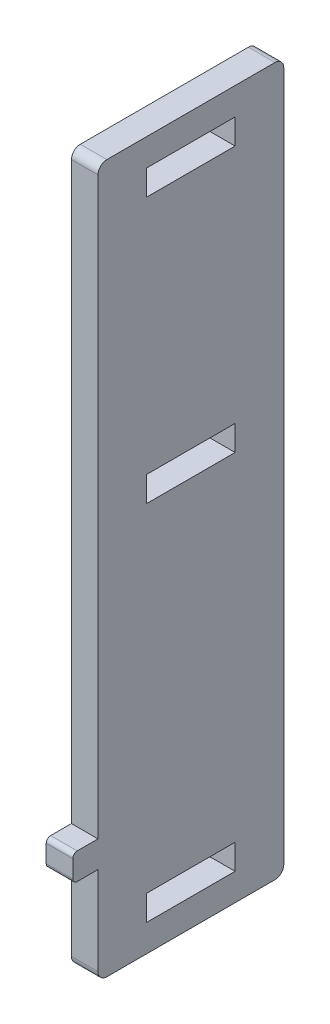
ISO-10303-21;
HEADER;
FILE_DESCRIPTION(('STEP AP214'),'2;1');
FILE_NAME('part.step','',(''),(''),'','','');
FILE_SCHEMA(('AUTOMOTIVE_DESIGN { 1 0 10303 214 1 1 1 1 }'));
ENDSEC;
DATA;
#1=APPLICATION_CONTEXT('core data for automotive mechanical design processes');
#2=APPLICATION_PROTOCOL_DEFINITION('international standard','automotive_design',2000,#1);
#3=PRODUCT_CONTEXT('',#1,'mechanical');
#4=PRODUCT('Part','Part','',(#3));
#5=PRODUCT_RELATED_PRODUCT_CATEGORY('part','',(#4));
#6=PRODUCT_DEFINITION_FORMATION('','',#4);
#7=PRODUCT_DEFINITION_CONTEXT('part definition',#1,'design');
#8=PRODUCT_DEFINITION('design','',#6,#7);
#9=PRODUCT_DEFINITION_SHAPE('','',#8);
#10=(LENGTH_UNIT() NAMED_UNIT(*) SI_UNIT(.MILLI.,.METRE.));
#11=(NAMED_UNIT(*) PLANE_ANGLE_UNIT() SI_UNIT($,.RADIAN.));
#12=(NAMED_UNIT(*) SI_UNIT($,.STERADIAN.) SOLID_ANGLE_UNIT());
#13=UNCERTAINTY_MEASURE_WITH_UNIT(LENGTH_MEASURE(1.E-05),#10,'distance_accuracy_value','');
#14=(GEOMETRIC_REPRESENTATION_CONTEXT(3) GLOBAL_UNCERTAINTY_ASSIGNED_CONTEXT((#13)) GLOBAL_UNIT_ASSIGNED_CONTEXT((#10,
#11,#12)) REPRESENTATION_CONTEXT('',''));
#15=CARTESIAN_POINT('',(0.,0.,0.));
#16=DIRECTION('',(0.,0.,1.));
#17=DIRECTION('',(1.,0.,0.));
#18=AXIS2_PLACEMENT_3D('',#15,#16,#17);
#19=CARTESIAN_POINT('',(3.,0.,0.));
#20=DIRECTION('',(-1.,0.,0.));
#21=DIRECTION('',(0.,0.,1.));
#22=AXIS2_PLACEMENT_3D('',#19,#20,#21);
#23=PLANE('',#22);
#24=DIRECTION('',(0.,1.,0.));
#25=VECTOR('',#24,1.);
#26=CARTESIAN_POINT('',(3.,6.925,-5.));
#27=LINE('',#26,#25);
#28=CARTESIAN_POINT('',(3.,4.07500000000001,-5.));
#29=VERTEX_POINT('',#28);
#30=CARTESIAN_POINT('',(3.,6.925,-5.));
#31=VERTEX_POINT('',#30);
#32=EDGE_CURVE('E483',#29,#31,#27,.T.);
#33=ORIENTED_EDGE('',*,*,#32,.F.);
#34=DIRECTION('',(0.,0.,-1.));
#35=VECTOR('',#34,1.);
#36=CARTESIAN_POINT('',(3.,4.07500000000001,5.));
#37=LINE('',#36,#35);
#38=CARTESIAN_POINT('',(3.,4.07500000000001,5.));
#39=VERTEX_POINT('',#38);
#40=EDGE_CURVE('E479',#39,#29,#37,.T.);
#41=ORIENTED_EDGE('',*,*,#40,.F.);
#42=DIRECTION('',(0.,-1.,0.));
#43=VECTOR('',#42,1.);
#44=CARTESIAN_POINT('',(3.,6.925,5.));
#45=LINE('',#44,#43);
#46=CARTESIAN_POINT('',(3.,6.925,5.));
#47=VERTEX_POINT('',#46);
#48=EDGE_CURVE('E494',#47,#39,#45,.T.);
#49=ORIENTED_EDGE('',*,*,#48,.F.);
#50=DIRECTION('',(0.,0.,1.));
#51=VECTOR('',#50,1.);
#52=CARTESIAN_POINT('',(3.,6.925,5.));
#53=LINE('',#52,#51);
#54=EDGE_CURVE('E501',#31,#47,#53,.T.);
#55=ORIENTED_EDGE('',*,*,#54,.F.);
#56=EDGE_LOOP('',(#33,#41,#49,#55));
#57=FACE_BOUND('',#56,.T.);
#58=DIRECTION('',(0.,-1.,0.));
#59=VECTOR('',#58,1.);
#60=CARTESIAN_POINT('',(3.,-26.,13.35));
#61=LINE('',#60,#59);
#62=CARTESIAN_POINT('',(3.,-26.5,13.35));
#63=VERTEX_POINT('',#62);
#64=CARTESIAN_POINT('',(3.,-28.5,13.35));
#65=VERTEX_POINT('',#64);
#66=EDGE_CURVE('E290',#63,#65,#61,.T.);
#67=ORIENTED_EDGE('',*,*,#66,.T.);
#68=CARTESIAN_POINT('',(3.,-28.5,12.85));
#69=DIRECTION('',(-1.,0.,0.));
#70=DIRECTION('',(0.,0.,1.));
#71=AXIS2_PLACEMENT_3D('',#68,#69,#70);
#72=CIRCLE('',#71,0.5);
#73=CARTESIAN_POINT('',(3.,-29.,12.85));
#74=VERTEX_POINT('',#73);
#75=EDGE_CURVE('E51',#65,#74,#72,.F.);
#76=ORIENTED_EDGE('',*,*,#75,.T.);
#77=DIRECTION('',(0.,0.,-1.));
#78=VECTOR('',#77,1.);
#79=CARTESIAN_POINT('',(3.,-29.,13.35));
#80=LINE('',#79,#78);
#81=CARTESIAN_POINT('',(3.,-29.,10.5));
#82=VERTEX_POINT('',#81);
#83=EDGE_CURVE('E297',#74,#82,#80,.T.);
#84=ORIENTED_EDGE('',*,*,#83,.T.);
#85=DIRECTION('',(0.,-1.,0.));
#86=VECTOR('',#85,1.);
#87=CARTESIAN_POINT('',(3.,-40.,10.5));
#88=LINE('',#87,#86);
#89=CARTESIAN_POINT('',(3.,-39.,10.5));
#90=VERTEX_POINT('',#89);
#91=EDGE_CURVE('E309',#82,#90,#88,.T.);
#92=ORIENTED_EDGE('',*,*,#91,.T.);
#93=CARTESIAN_POINT('',(3.,-39.,9.5));
#94=DIRECTION('',(-1.,0.,0.));
#95=DIRECTION('',(0.,0.,1.));
#96=AXIS2_PLACEMENT_3D('',#93,#94,#95);
#97=CIRCLE('',#96,1.);
#98=CARTESIAN_POINT('',(3.,-40.,9.5));
#99=VERTEX_POINT('',#98);
#100=EDGE_CURVE('E367',#90,#99,#97,.F.);
#101=ORIENTED_EDGE('',*,*,#100,.T.);
#102=DIRECTION('',(0.,0.,-1.));
#103=VECTOR('',#102,1.);
#104=CARTESIAN_POINT('',(3.,-40.,10.5));
#105=LINE('',#104,#103);
#106=CARTESIAN_POINT('',(3.,-40.,-9.5));
#107=VERTEX_POINT('',#106);
#108=EDGE_CURVE('E313',#99,#107,#105,.T.);
#109=ORIENTED_EDGE('',*,*,#108,.T.);
#110=CARTESIAN_POINT('',(3.,-39.,-9.5));
#111=DIRECTION('',(-1.,0.,0.));
#112=DIRECTION('',(0.,0.,1.));
#113=AXIS2_PLACEMENT_3D('',#110,#111,#112);
#114=CIRCLE('',#113,1.);
#115=CARTESIAN_POINT('',(3.,-39.,-10.5));
#116=VERTEX_POINT('',#115);
#117=EDGE_CURVE('E370',#107,#116,#114,.F.);
#118=ORIENTED_EDGE('',*,*,#117,.T.);
#119=DIRECTION('',(0.,1.,0.));
#120=VECTOR('',#119,1.);
#121=CARTESIAN_POINT('',(3.,-40.,-10.5));
#122=LINE('',#121,#120);
#123=CARTESIAN_POINT('',(3.,39.,-10.5));
#124=VERTEX_POINT('',#123);
#125=EDGE_CURVE('E340',#116,#124,#122,.T.);
#126=ORIENTED_EDGE('',*,*,#125,.T.);
#127=CARTESIAN_POINT('',(3.,39.,-9.5));
#128=DIRECTION('',(-1.,0.,0.));
#129=DIRECTION('',(0.,0.,1.));
#130=AXIS2_PLACEMENT_3D('',#127,#128,#129);
#131=CIRCLE('',#130,1.);
#132=CARTESIAN_POINT('',(3.,40.,-9.5));
#133=VERTEX_POINT('',#132);
#134=EDGE_CURVE('E373',#124,#133,#131,.F.);
#135=ORIENTED_EDGE('',*,*,#134,.T.);
#136=DIRECTION('',(0.,0.,1.));
#137=VECTOR('',#136,1.);
#138=CARTESIAN_POINT('',(3.,40.,10.5));
#139=LINE('',#138,#137);
#140=CARTESIAN_POINT('',(3.,40.,9.5));
#141=VERTEX_POINT('',#140);
#142=EDGE_CURVE('E440',#133,#141,#139,.T.);
#143=ORIENTED_EDGE('',*,*,#142,.T.);
#144=CARTESIAN_POINT('',(3.,39.,9.5));
#145=DIRECTION('',(-1.,0.,0.));
#146=DIRECTION('',(0.,0.,1.));
#147=AXIS2_PLACEMENT_3D('',#144,#145,#146);
#148=CIRCLE('',#147,1.);
#149=CARTESIAN_POINT('',(3.,39.,10.5));
#150=VERTEX_POINT('',#149);
#151=EDGE_CURVE('E364',#141,#150,#148,.F.);
#152=ORIENTED_EDGE('',*,*,#151,.T.);
#153=DIRECTION('',(0.,-1.,0.));
#154=VECTOR('',#153,1.);
#155=CARTESIAN_POINT('',(3.,-26.,10.5));
#156=LINE('',#155,#154);
#157=CARTESIAN_POINT('',(3.,-26.,10.5));
#158=VERTEX_POINT('',#157);
#159=EDGE_CURVE('E291',#150,#158,#156,.T.);
#160=ORIENTED_EDGE('',*,*,#159,.T.);
#161=DIRECTION('',(0.,0.,1.));
#162=VECTOR('',#161,1.);
#163=CARTESIAN_POINT('',(3.,-26.,13.35));
#164=LINE('',#163,#162);
#165=CARTESIAN_POINT('',(3.,-26.,12.85));
#166=VERTEX_POINT('',#165);
#167=EDGE_CURVE('E286',#158,#166,#164,.T.);
#168=ORIENTED_EDGE('',*,*,#167,.T.);
#169=CARTESIAN_POINT('',(3.,-26.5,12.85));
#170=DIRECTION('',(-1.,0.,0.));
#171=DIRECTION('',(0.,0.,1.));
#172=AXIS2_PLACEMENT_3D('',#169,#170,#171);
#173=CIRCLE('',#172,0.5);
#174=EDGE_CURVE('E397',#166,#63,#173,.F.);
#175=ORIENTED_EDGE('',*,*,#174,.T.);
#176=EDGE_LOOP('',(#67,#76,#84,#92,#101,#109,#118,#126,#135,#143,#152,#160,#168,#175));
#177=FACE_BOUND('',#176,.T.);
#178=DIRECTION('',(0.,1.,0.));
#179=VECTOR('',#178,1.);
#180=CARTESIAN_POINT('',(3.,-34.075,-5.));
#181=LINE('',#180,#179);
#182=CARTESIAN_POINT('',(3.,-36.925,-5.));
#183=VERTEX_POINT('',#182);
#184=CARTESIAN_POINT('',(3.,-34.075,-5.));
#185=VERTEX_POINT('',#184);
#186=EDGE_CURVE('E266',#183,#185,#181,.T.);
#187=ORIENTED_EDGE('',*,*,#186,.F.);
#188=DIRECTION('',(0.,0.,-1.));
#189=VECTOR('',#188,1.);
#190=CARTESIAN_POINT('',(3.,-36.925,5.));
#191=LINE('',#190,#189);
#192=CARTESIAN_POINT('',(3.,-36.925,5.));
#193=VERTEX_POINT('',#192);
#194=EDGE_CURVE('E273',#193,#183,#191,.T.);
#195=ORIENTED_EDGE('',*,*,#194,.F.);
#196=DIRECTION('',(0.,-1.,0.));
#197=VECTOR('',#196,1.);
#198=CARTESIAN_POINT('',(3.,-34.075,5.));
#199=LINE('',#198,#197);
#200=CARTESIAN_POINT('',(3.,-34.075,5.));
#201=VERTEX_POINT('',#200);
#202=EDGE_CURVE('E265',#201,#193,#199,.T.);
#203=ORIENTED_EDGE('',*,*,#202,.F.);
#204=DIRECTION('',(0.,0.,1.));
#205=VECTOR('',#204,1.);
#206=CARTESIAN_POINT('',(3.,-34.075,5.));
#207=LINE('',#206,#205);
#208=EDGE_CURVE('E261',#185,#201,#207,.T.);
#209=ORIENTED_EDGE('',*,*,#208,.F.);
#210=EDGE_LOOP('',(#187,#195,#203,#209));
#211=FACE_BOUND('',#210,.T.);
#212=DIRECTION('',(0.,1.,0.));
#213=VECTOR('',#212,1.);
#214=CARTESIAN_POINT('',(3.,36.925,-5.));
#215=LINE('',#214,#213);
#216=CARTESIAN_POINT('',(3.,34.075,-5.));
#217=VERTEX_POINT('',#216);
#218=CARTESIAN_POINT('',(3.,36.925,-5.));
#219=VERTEX_POINT('',#218);
#220=EDGE_CURVE('E219',#217,#219,#215,.T.);
#221=ORIENTED_EDGE('',*,*,#220,.F.);
#222=DIRECTION('',(0.,0.,-1.));
#223=VECTOR('',#222,1.);
#224=CARTESIAN_POINT('',(3.,34.075,5.));
#225=LINE('',#224,#223);
#226=CARTESIAN_POINT('',(3.,34.075,5.));
#227=VERTEX_POINT('',#226);
#228=EDGE_CURVE('E246',#227,#217,#225,.T.);
#229=ORIENTED_EDGE('',*,*,#228,.F.);
#230=DIRECTION('',(0.,-1.,0.));
#231=VECTOR('',#230,1.);
#232=CARTESIAN_POINT('',(3.,36.925,5.));
#233=LINE('',#232,#231);
#234=CARTESIAN_POINT('',(3.,36.925,5.));
#235=VERTEX_POINT('',#234);
#236=EDGE_CURVE('E243',#235,#227,#233,.T.);
#237=ORIENTED_EDGE('',*,*,#236,.F.);
#238=DIRECTION('',(0.,0.,1.));
#239=VECTOR('',#238,1.);
#240=CARTESIAN_POINT('',(3.,36.925,5.));
#241=LINE('',#240,#239);
#242=EDGE_CURVE('E230',#219,#235,#241,.T.);
#243=ORIENTED_EDGE('',*,*,#242,.F.);
#244=EDGE_LOOP('',(#221,#229,#237,#243));
#245=FACE_BOUND('',#244,.T.);
#246=ADVANCED_FACE('F43',(#57,#177,#211,#245),#23,.F.);
#247=CARTESIAN_POINT('',(0.,0.,0.));
#248=DIRECTION('',(-1.,0.,0.));
#249=DIRECTION('',(0.,0.,1.));
#250=AXIS2_PLACEMENT_3D('',#247,#248,#249);
#251=PLANE('',#250);
#252=DIRECTION('',(0.,0.,-1.));
#253=VECTOR('',#252,1.);
#254=CARTESIAN_POINT('',(0.,-29.,13.35));
#255=LINE('',#254,#253);
#256=CARTESIAN_POINT('',(0.,-29.,12.85));
#257=VERTEX_POINT('',#256);
#258=CARTESIAN_POINT('',(0.,-29.,10.5));
#259=VERTEX_POINT('',#258);
#260=EDGE_CURVE('E332',#257,#259,#255,.T.);
#261=ORIENTED_EDGE('',*,*,#260,.F.);
#262=CARTESIAN_POINT('',(0.,-28.5,12.85));
#263=DIRECTION('',(-1.,0.,0.));
#264=DIRECTION('',(0.,0.,1.));
#265=AXIS2_PLACEMENT_3D('',#262,#263,#264);
#266=CIRCLE('',#265,0.5);
#267=CARTESIAN_POINT('',(0.,-28.5,13.35));
#268=VERTEX_POINT('',#267);
#269=EDGE_CURVE('E391',#257,#268,#266,.T.);
#270=ORIENTED_EDGE('',*,*,#269,.T.);
#271=DIRECTION('',(0.,-1.,0.));
#272=VECTOR('',#271,1.);
#273=CARTESIAN_POINT('',(0.,-26.,13.35));
#274=LINE('',#273,#272);
#275=CARTESIAN_POINT('',(0.,-26.5,13.35));
#276=VERTEX_POINT('',#275);
#277=EDGE_CURVE('E330',#276,#268,#274,.T.);
#278=ORIENTED_EDGE('',*,*,#277,.F.);
#279=CARTESIAN_POINT('',(0.,-26.5,12.85));
#280=DIRECTION('',(-1.,0.,0.));
#281=DIRECTION('',(0.,0.,1.));
#282=AXIS2_PLACEMENT_3D('',#279,#280,#281);
#283=CIRCLE('',#282,0.5);
#284=CARTESIAN_POINT('',(0.,-26.,12.85));
#285=VERTEX_POINT('',#284);
#286=EDGE_CURVE('E389',#276,#285,#283,.T.);
#287=ORIENTED_EDGE('',*,*,#286,.T.);
#288=DIRECTION('',(0.,0.,1.));
#289=VECTOR('',#288,1.);
#290=CARTESIAN_POINT('',(0.,-26.,13.35));
#291=LINE('',#290,#289);
#292=CARTESIAN_POINT('',(0.,-26.,10.5));
#293=VERTEX_POINT('',#292);
#294=EDGE_CURVE('E328',#293,#285,#291,.T.);
#295=ORIENTED_EDGE('',*,*,#294,.F.);
#296=DIRECTION('',(0.,-1.,0.));
#297=VECTOR('',#296,1.);
#298=CARTESIAN_POINT('',(0.,-26.,10.5));
#299=LINE('',#298,#297);
#300=CARTESIAN_POINT('',(0.,39.,10.5));
#301=VERTEX_POINT('',#300);
#302=EDGE_CURVE('E326',#301,#293,#299,.T.);
#303=ORIENTED_EDGE('',*,*,#302,.F.);
#304=CARTESIAN_POINT('',(0.,39.,9.5));
#305=DIRECTION('',(-1.,0.,0.));
#306=DIRECTION('',(0.,0.,1.));
#307=AXIS2_PLACEMENT_3D('',#304,#305,#306);
#308=CIRCLE('',#307,1.);
#309=CARTESIAN_POINT('',(0.,40.,9.5));
#310=VERTEX_POINT('',#309);
#311=EDGE_CURVE('E351',#301,#310,#308,.T.);
#312=ORIENTED_EDGE('',*,*,#311,.T.);
#313=DIRECTION('',(0.,0.,1.));
#314=VECTOR('',#313,1.);
#315=CARTESIAN_POINT('',(0.,40.,10.5));
#316=LINE('',#315,#314);
#317=CARTESIAN_POINT('',(0.,40.,-9.5));
#318=VERTEX_POINT('',#317);
#319=EDGE_CURVE('E322',#318,#310,#316,.T.);
#320=ORIENTED_EDGE('',*,*,#319,.F.);
#321=CARTESIAN_POINT('',(0.,39.,-9.5));
#322=DIRECTION('',(-1.,0.,0.));
#323=DIRECTION('',(0.,0.,1.));
#324=AXIS2_PLACEMENT_3D('',#321,#322,#323);
#325=CIRCLE('',#324,1.);
#326=CARTESIAN_POINT('',(0.,39.,-10.5));
#327=VERTEX_POINT('',#326);
#328=EDGE_CURVE('E357',#318,#327,#325,.T.);
#329=ORIENTED_EDGE('',*,*,#328,.T.);
#330=DIRECTION('',(0.,1.,0.));
#331=VECTOR('',#330,1.);
#332=CARTESIAN_POINT('',(0.,-40.,-10.5));
#333=LINE('',#332,#331);
#334=CARTESIAN_POINT('',(0.,-39.,-10.5));
#335=VERTEX_POINT('',#334);
#336=EDGE_CURVE('E319',#335,#327,#333,.T.);
#337=ORIENTED_EDGE('',*,*,#336,.F.);
#338=CARTESIAN_POINT('',(0.,-39.,-9.5));
#339=DIRECTION('',(-1.,0.,0.));
#340=DIRECTION('',(0.,0.,1.));
#341=AXIS2_PLACEMENT_3D('',#338,#339,#340);
#342=CIRCLE('',#341,1.);
#343=CARTESIAN_POINT('',(0.,-40.,-9.5));
#344=VERTEX_POINT('',#343);
#345=EDGE_CURVE('E355',#335,#344,#342,.T.);
#346=ORIENTED_EDGE('',*,*,#345,.T.);
#347=DIRECTION('',(0.,0.,-1.));
#348=VECTOR('',#347,1.);
#349=CARTESIAN_POINT('',(0.,-40.,10.5));
#350=LINE('',#349,#348);
#351=CARTESIAN_POINT('',(0.,-40.,9.5));
#352=VERTEX_POINT('',#351);
#353=EDGE_CURVE('E337',#352,#344,#350,.T.);
#354=ORIENTED_EDGE('',*,*,#353,.F.);
#355=CARTESIAN_POINT('',(0.,-39.,9.5));
#356=DIRECTION('',(-1.,0.,0.));
#357=DIRECTION('',(0.,0.,1.));
#358=AXIS2_PLACEMENT_3D('',#355,#356,#357);
#359=CIRCLE('',#358,1.);
#360=CARTESIAN_POINT('',(0.,-39.,10.5));
#361=VERTEX_POINT('',#360);
#362=EDGE_CURVE('E353',#352,#361,#359,.T.);
#363=ORIENTED_EDGE('',*,*,#362,.T.);
#364=DIRECTION('',(0.,-1.,0.));
#365=VECTOR('',#364,1.);
#366=CARTESIAN_POINT('',(0.,-40.,10.5));
#367=LINE('',#366,#365);
#368=EDGE_CURVE('E334',#259,#361,#367,.T.);
#369=ORIENTED_EDGE('',*,*,#368,.F.);
#370=EDGE_LOOP('',(#261,#270,#278,#287,#295,#303,#312,#320,#329,#337,#346,#354,#363,#369));
#371=FACE_BOUND('',#370,.T.);
#372=DIRECTION('',(0.,0.,-1.));
#373=VECTOR('',#372,1.);
#374=CARTESIAN_POINT('',(0.,-36.925,5.));
#375=LINE('',#374,#373);
#376=CARTESIAN_POINT('',(0.,-36.925,5.));
#377=VERTEX_POINT('',#376);
#378=CARTESIAN_POINT('',(0.,-36.925,-5.));
#379=VERTEX_POINT('',#378);
#380=EDGE_CURVE('E458',#377,#379,#375,.T.);
#381=ORIENTED_EDGE('',*,*,#380,.T.);
#382=DIRECTION('',(0.,1.,0.));
#383=VECTOR('',#382,1.);
#384=CARTESIAN_POINT('',(0.,-34.075,-5.));
#385=LINE('',#384,#383);
#386=CARTESIAN_POINT('',(0.,-34.075,-5.));
#387=VERTEX_POINT('',#386);
#388=EDGE_CURVE('E278',#379,#387,#385,.T.);
#389=ORIENTED_EDGE('',*,*,#388,.T.);
#390=DIRECTION('',(0.,0.,1.));
#391=VECTOR('',#390,1.);
#392=CARTESIAN_POINT('',(0.,-34.075,5.));
#393=LINE('',#392,#391);
#394=CARTESIAN_POINT('',(0.,-34.075,5.));
#395=VERTEX_POINT('',#394);
#396=EDGE_CURVE('E463',#387,#395,#393,.T.);
#397=ORIENTED_EDGE('',*,*,#396,.T.);
#398=DIRECTION('',(0.,-1.,0.));
#399=VECTOR('',#398,1.);
#400=CARTESIAN_POINT('',(0.,-34.075,5.));
#401=LINE('',#400,#399);
#402=EDGE_CURVE('E461',#395,#377,#401,.T.);
#403=ORIENTED_EDGE('',*,*,#402,.T.);
#404=EDGE_LOOP('',(#381,#389,#397,#403));
#405=FACE_BOUND('',#404,.T.);
#406=DIRECTION('',(0.,0.,-1.));
#407=VECTOR('',#406,1.);
#408=CARTESIAN_POINT('',(0.,4.07500000000001,5.));
#409=LINE('',#408,#407);
#410=CARTESIAN_POINT('',(0.,4.07500000000001,5.));
#411=VERTEX_POINT('',#410);
#412=CARTESIAN_POINT('',(0.,4.07500000000001,-5.));
#413=VERTEX_POINT('',#412);
#414=EDGE_CURVE('E480',#411,#413,#409,.T.);
#415=ORIENTED_EDGE('',*,*,#414,.T.);
#416=DIRECTION('',(0.,1.,0.));
#417=VECTOR('',#416,1.);
#418=CARTESIAN_POINT('',(0.,6.925,-5.));
#419=LINE('',#418,#417);
#420=CARTESIAN_POINT('',(0.,6.925,-5.));
#421=VERTEX_POINT('',#420);
#422=EDGE_CURVE('E238',#413,#421,#419,.T.);
#423=ORIENTED_EDGE('',*,*,#422,.T.);
#424=DIRECTION('',(0.,0.,1.));
#425=VECTOR('',#424,1.);
#426=CARTESIAN_POINT('',(0.,6.925,5.));
#427=LINE('',#426,#425);
#428=CARTESIAN_POINT('',(0.,6.925,5.));
#429=VERTEX_POINT('',#428);
#430=EDGE_CURVE('E487',#421,#429,#427,.T.);
#431=ORIENTED_EDGE('',*,*,#430,.T.);
#432=DIRECTION('',(0.,-1.,0.));
#433=VECTOR('',#432,1.);
#434=CARTESIAN_POINT('',(0.,6.925,5.));
#435=LINE('',#434,#433);
#436=EDGE_CURVE('E484',#429,#411,#435,.T.);
#437=ORIENTED_EDGE('',*,*,#436,.T.);
#438=EDGE_LOOP('',(#415,#423,#431,#437));
#439=FACE_BOUND('',#438,.T.);
#440=DIRECTION('',(0.,0.,-1.));
#441=VECTOR('',#440,1.);
#442=CARTESIAN_POINT('',(0.,34.075,5.));
#443=LINE('',#442,#441);
#444=CARTESIAN_POINT('',(0.,34.075,5.));
#445=VERTEX_POINT('',#444);
#446=CARTESIAN_POINT('',(0.,34.075,-5.));
#447=VERTEX_POINT('',#446);
#448=EDGE_CURVE('E231',#445,#447,#443,.T.);
#449=ORIENTED_EDGE('',*,*,#448,.T.);
#450=DIRECTION('',(0.,1.,0.));
#451=VECTOR('',#450,1.);
#452=CARTESIAN_POINT('',(0.,36.925,-5.));
#453=LINE('',#452,#451);
#454=CARTESIAN_POINT('',(0.,36.925,-5.));
#455=VERTEX_POINT('',#454);
#456=EDGE_CURVE('E792',#447,#455,#453,.T.);
#457=ORIENTED_EDGE('',*,*,#456,.T.);
#458=DIRECTION('',(0.,0.,1.));
#459=VECTOR('',#458,1.);
#460=CARTESIAN_POINT('',(0.,36.925,5.));
#461=LINE('',#460,#459);
#462=CARTESIAN_POINT('',(0.,36.925,5.));
#463=VERTEX_POINT('',#462);
#464=EDGE_CURVE('E237',#455,#463,#461,.T.);
#465=ORIENTED_EDGE('',*,*,#464,.T.);
#466=DIRECTION('',(0.,-1.,0.));
#467=VECTOR('',#466,1.);
#468=CARTESIAN_POINT('',(0.,36.925,5.));
#469=LINE('',#468,#467);
#470=EDGE_CURVE('E791',#463,#445,#469,.T.);
#471=ORIENTED_EDGE('',*,*,#470,.T.);
#472=EDGE_LOOP('',(#449,#457,#465,#471));
#473=FACE_BOUND('',#472,.T.);
#474=ADVANCED_FACE('F415',(#371,#405,#439,#473),#251,.T.);
#475=CARTESIAN_POINT('',(3.,-40.,-10.5));
#476=DIRECTION('',(0.,0.,1.));
#477=DIRECTION('',(0.,-1.,0.));
#478=AXIS2_PLACEMENT_3D('',#475,#476,#477);
#479=PLANE('',#478);
#480=ORIENTED_EDGE('',*,*,#336,.T.);
#481=DIRECTION('',(-1.,0.,0.));
#482=VECTOR('',#481,1.);
#483=CARTESIAN_POINT('',(3.,39.,-10.5));
#484=LINE('',#483,#482);
#485=EDGE_CURVE('E362',#327,#124,#484,.F.);
#486=ORIENTED_EDGE('',*,*,#485,.T.);
#487=ORIENTED_EDGE('',*,*,#125,.F.);
#488=DIRECTION('',(-1.,0.,0.));
#489=VECTOR('',#488,1.);
#490=CARTESIAN_POINT('',(3.,-39.,-10.5));
#491=LINE('',#490,#489);
#492=EDGE_CURVE('E359',#116,#335,#491,.T.);
#493=ORIENTED_EDGE('',*,*,#492,.T.);
#494=EDGE_LOOP('',(#480,#486,#487,#493));
#495=FACE_BOUND('',#494,.T.);
#496=ADVANCED_FACE('F539',(#495),#479,.F.);
#497=CARTESIAN_POINT('',(3.,40.,10.5));
#498=DIRECTION('',(0.,-1.,0.));
#499=DIRECTION('',(0.,0.,-1.));
#500=AXIS2_PLACEMENT_3D('',#497,#498,#499);
#501=PLANE('',#500);
#502=ORIENTED_EDGE('',*,*,#142,.F.);
#503=DIRECTION('',(-1.,0.,0.));
#504=VECTOR('',#503,1.);
#505=CARTESIAN_POINT('',(3.,40.,-9.5));
#506=LINE('',#505,#504);
#507=EDGE_CURVE('E348',#133,#318,#506,.T.);
#508=ORIENTED_EDGE('',*,*,#507,.T.);
#509=ORIENTED_EDGE('',*,*,#319,.T.);
#510=DIRECTION('',(-1.,0.,0.));
#511=VECTOR('',#510,1.);
#512=CARTESIAN_POINT('',(3.,40.,9.5));
#513=LINE('',#512,#511);
#514=EDGE_CURVE('E346',#310,#141,#513,.F.);
#515=ORIENTED_EDGE('',*,*,#514,.T.);
#516=EDGE_LOOP('',(#502,#508,#509,#515));
#517=FACE_BOUND('',#516,.T.);
#518=ADVANCED_FACE('F435',(#517),#501,.F.);
#519=CARTESIAN_POINT('',(3.,-26.,10.5));
#520=DIRECTION('',(0.,0.,-1.));
#521=DIRECTION('',(-1.,0.,0.));
#522=AXIS2_PLACEMENT_3D('',#519,#520,#521);
#523=PLANE('',#522);
#524=ORIENTED_EDGE('',*,*,#159,.F.);
#525=DIRECTION('',(-1.,0.,0.));
#526=VECTOR('',#525,1.);
#527=CARTESIAN_POINT('',(3.,39.,10.5));
#528=LINE('',#527,#526);
#529=EDGE_CURVE('E383',#150,#301,#528,.T.);
#530=ORIENTED_EDGE('',*,*,#529,.T.);
#531=ORIENTED_EDGE('',*,*,#302,.T.);
#532=DIRECTION('',(-1.,0.,0.));
#533=VECTOR('',#532,1.);
#534=CARTESIAN_POINT('',(3.,-26.,10.5));
#535=LINE('',#534,#533);
#536=EDGE_CURVE('E343',#158,#293,#535,.T.);
#537=ORIENTED_EDGE('',*,*,#536,.F.);
#538=EDGE_LOOP('',(#524,#530,#531,#537));
#539=FACE_BOUND('',#538,.T.);
#540=ADVANCED_FACE('F428',(#539),#523,.F.);
#541=CARTESIAN_POINT('',(3.,-26.,13.35));
#542=DIRECTION('',(0.,-1.,0.));
#543=DIRECTION('',(0.,0.,-1.));
#544=AXIS2_PLACEMENT_3D('',#541,#542,#543);
#545=PLANE('',#544);
#546=ORIENTED_EDGE('',*,*,#294,.T.);
#547=DIRECTION('',(-1.,0.,0.));
#548=VECTOR('',#547,1.);
#549=CARTESIAN_POINT('',(3.,-26.,12.85));
#550=LINE('',#549,#548);
#551=EDGE_CURVE('E12',#285,#166,#550,.F.);
#552=ORIENTED_EDGE('',*,*,#551,.T.);
#553=ORIENTED_EDGE('',*,*,#167,.F.);
#554=ORIENTED_EDGE('',*,*,#536,.T.);
#555=EDGE_LOOP('',(#546,#552,#553,#554));
#556=FACE_BOUND('',#555,.T.);
#557=ADVANCED_FACE('F424',(#556),#545,.F.);
#558=CARTESIAN_POINT('',(3.,-26.,13.35));
#559=DIRECTION('',(0.,0.,-1.));
#560=DIRECTION('',(0.,1.,0.));
#561=AXIS2_PLACEMENT_3D('',#558,#559,#560);
#562=PLANE('',#561);
#563=ORIENTED_EDGE('',*,*,#277,.T.);
#564=DIRECTION('',(-1.,0.,0.));
#565=VECTOR('',#564,1.);
#566=CARTESIAN_POINT('',(3.,-28.5,13.35));
#567=LINE('',#566,#565);
#568=EDGE_CURVE('E64',#268,#65,#567,.F.);
#569=ORIENTED_EDGE('',*,*,#568,.T.);
#570=ORIENTED_EDGE('',*,*,#66,.F.);
#571=DIRECTION('',(-1.,0.,0.));
#572=VECTOR('',#571,1.);
#573=CARTESIAN_POINT('',(3.,-26.5,13.35));
#574=LINE('',#573,#572);
#575=EDGE_CURVE('E393',#63,#276,#574,.T.);
#576=ORIENTED_EDGE('',*,*,#575,.T.);
#577=EDGE_LOOP('',(#563,#569,#570,#576));
#578=FACE_BOUND('',#577,.T.);
#579=ADVANCED_FACE('F418',(#578),#562,.F.);
#580=CARTESIAN_POINT('',(3.,-29.,13.35));
#581=DIRECTION('',(0.,1.,0.));
#582=DIRECTION('',(0.,0.,1.));
#583=AXIS2_PLACEMENT_3D('',#580,#581,#582);
#584=PLANE('',#583);
#585=ORIENTED_EDGE('',*,*,#83,.F.);
#586=DIRECTION('',(-1.,0.,0.));
#587=VECTOR('',#586,1.);
#588=CARTESIAN_POINT('',(3.,-29.,12.85));
#589=LINE('',#588,#587);
#590=EDGE_CURVE('E386',#74,#257,#589,.T.);
#591=ORIENTED_EDGE('',*,*,#590,.T.);
#592=ORIENTED_EDGE('',*,*,#260,.T.);
#593=DIRECTION('',(-1.,0.,0.));
#594=VECTOR('',#593,1.);
#595=CARTESIAN_POINT('',(3.,-29.,10.5));
#596=LINE('',#595,#594);
#597=EDGE_CURVE('E318',#82,#259,#596,.T.);
#598=ORIENTED_EDGE('',*,*,#597,.F.);
#599=EDGE_LOOP('',(#585,#591,#592,#598));
#600=FACE_BOUND('',#599,.T.);
#601=ADVANCED_FACE('F409',(#600),#584,.F.);
#602=CARTESIAN_POINT('',(3.,-40.,10.5));
#603=DIRECTION('',(0.,0.,-1.));
#604=DIRECTION('',(-1.,0.,0.));
#605=AXIS2_PLACEMENT_3D('',#602,#603,#604);
#606=PLANE('',#605);
#607=ORIENTED_EDGE('',*,*,#368,.T.);
#608=DIRECTION('',(-1.,0.,0.));
#609=VECTOR('',#608,1.);
#610=CARTESIAN_POINT('',(3.,-39.,10.5));
#611=LINE('',#610,#609);
#612=EDGE_CURVE('E381',#361,#90,#611,.F.);
#613=ORIENTED_EDGE('',*,*,#612,.T.);
#614=ORIENTED_EDGE('',*,*,#91,.F.);
#615=ORIENTED_EDGE('',*,*,#597,.T.);
#616=EDGE_LOOP('',(#607,#613,#614,#615));
#617=FACE_BOUND('',#616,.T.);
#618=ADVANCED_FACE('F548',(#617),#606,.F.);
#619=CARTESIAN_POINT('',(3.,-40.,10.5));
#620=DIRECTION('',(0.,1.,0.));
#621=DIRECTION('',(0.,0.,1.));
#622=AXIS2_PLACEMENT_3D('',#619,#620,#621);
#623=PLANE('',#622);
#624=ORIENTED_EDGE('',*,*,#353,.T.);
#625=DIRECTION('',(-1.,0.,0.));
#626=VECTOR('',#625,1.);
#627=CARTESIAN_POINT('',(3.,-40.,-9.5));
#628=LINE('',#627,#626);
#629=EDGE_CURVE('E379',#344,#107,#628,.F.);
#630=ORIENTED_EDGE('',*,*,#629,.T.);
#631=ORIENTED_EDGE('',*,*,#108,.F.);
#632=DIRECTION('',(-1.,0.,0.));
#633=VECTOR('',#632,1.);
#634=CARTESIAN_POINT('',(3.,-40.,9.5));
#635=LINE('',#634,#633);
#636=EDGE_CURVE('E376',#99,#352,#635,.T.);
#637=ORIENTED_EDGE('',*,*,#636,.T.);
#638=EDGE_LOOP('',(#624,#630,#631,#637));
#639=FACE_BOUND('',#638,.T.);
#640=ADVANCED_FACE('F545',(#639),#623,.F.);
#641=CARTESIAN_POINT('',(3.,-34.075,-5.));
#642=DIRECTION('',(0.,0.,1.));
#643=DIRECTION('',(0.,-1.,0.));
#644=AXIS2_PLACEMENT_3D('',#641,#642,#643);
#645=PLANE('',#644);
#646=ORIENTED_EDGE('',*,*,#388,.F.);
#647=DIRECTION('',(-1.,0.,0.));
#648=VECTOR('',#647,1.);
#649=CARTESIAN_POINT('',(3.,-36.925,-5.));
#650=LINE('',#649,#648);
#651=EDGE_CURVE('E277',#183,#379,#650,.T.);
#652=ORIENTED_EDGE('',*,*,#651,.F.);
#653=ORIENTED_EDGE('',*,*,#186,.T.);
#654=DIRECTION('',(-1.,0.,0.));
#655=VECTOR('',#654,1.);
#656=CARTESIAN_POINT('',(3.,-34.075,-5.));
#657=LINE('',#656,#655);
#658=EDGE_CURVE('E323',#185,#387,#657,.T.);
#659=ORIENTED_EDGE('',*,*,#658,.T.);
#660=EDGE_LOOP('',(#646,#652,#653,#659));
#661=FACE_BOUND('',#660,.T.);
#662=ADVANCED_FACE('F542',(#661),#645,.T.);
#663=CARTESIAN_POINT('',(3.,-34.075,5.));
#664=DIRECTION('',(0.,-1.,0.));
#665=DIRECTION('',(0.,0.,-1.));
#666=AXIS2_PLACEMENT_3D('',#663,#664,#665);
#667=PLANE('',#666);
#668=ORIENTED_EDGE('',*,*,#396,.F.);
#669=ORIENTED_EDGE('',*,*,#658,.F.);
#670=ORIENTED_EDGE('',*,*,#208,.T.);
#671=DIRECTION('',(-1.,0.,0.));
#672=VECTOR('',#671,1.);
#673=CARTESIAN_POINT('',(3.,-34.075,5.));
#674=LINE('',#673,#672);
#675=EDGE_CURVE('E452',#201,#395,#674,.T.);
#676=ORIENTED_EDGE('',*,*,#675,.T.);
#677=EDGE_LOOP('',(#668,#669,#670,#676));
#678=FACE_BOUND('',#677,.T.);
#679=ADVANCED_FACE('F752',(#678),#667,.T.);
#680=CARTESIAN_POINT('',(3.,-34.075,5.));
#681=DIRECTION('',(0.,0.,-1.));
#682=DIRECTION('',(-1.,0.,0.));
#683=AXIS2_PLACEMENT_3D('',#680,#681,#682);
#684=PLANE('',#683);
#685=ORIENTED_EDGE('',*,*,#402,.F.);
#686=ORIENTED_EDGE('',*,*,#675,.F.);
#687=ORIENTED_EDGE('',*,*,#202,.T.);
#688=DIRECTION('',(-1.,0.,0.));
#689=VECTOR('',#688,1.);
#690=CARTESIAN_POINT('',(3.,-36.925,5.));
#691=LINE('',#690,#689);
#692=EDGE_CURVE('E454',#193,#377,#691,.T.);
#693=ORIENTED_EDGE('',*,*,#692,.T.);
#694=EDGE_LOOP('',(#685,#686,#687,#693));
#695=FACE_BOUND('',#694,.T.);
#696=ADVANCED_FACE('F742',(#695),#684,.T.);
#697=CARTESIAN_POINT('',(3.,-36.925,5.));
#698=DIRECTION('',(0.,1.,0.));
#699=DIRECTION('',(0.,0.,1.));
#700=AXIS2_PLACEMENT_3D('',#697,#698,#699);
#701=PLANE('',#700);
#702=ORIENTED_EDGE('',*,*,#380,.F.);
#703=ORIENTED_EDGE('',*,*,#692,.F.);
#704=ORIENTED_EDGE('',*,*,#194,.T.);
#705=ORIENTED_EDGE('',*,*,#651,.T.);
#706=EDGE_LOOP('',(#702,#703,#704,#705));
#707=FACE_BOUND('',#706,.T.);
#708=ADVANCED_FACE('F532',(#707),#701,.T.);
#709=CARTESIAN_POINT('',(3.,6.925,-5.));
#710=DIRECTION('',(0.,0.,1.));
#711=DIRECTION('',(1.,0.,0.));
#712=AXIS2_PLACEMENT_3D('',#709,#710,#711);
#713=PLANE('',#712);
#714=ORIENTED_EDGE('',*,*,#422,.F.);
#715=DIRECTION('',(-1.,0.,0.));
#716=VECTOR('',#715,1.);
#717=CARTESIAN_POINT('',(3.,4.07500000000001,-5.));
#718=LINE('',#717,#716);
#719=EDGE_CURVE('E476',#29,#413,#718,.T.);
#720=ORIENTED_EDGE('',*,*,#719,.F.);
#721=ORIENTED_EDGE('',*,*,#32,.T.);
#722=DIRECTION('',(-1.,0.,0.));
#723=VECTOR('',#722,1.);
#724=CARTESIAN_POINT('',(3.,6.925,-5.));
#725=LINE('',#724,#723);
#726=EDGE_CURVE('E466',#31,#421,#725,.T.);
#727=ORIENTED_EDGE('',*,*,#726,.T.);
#728=EDGE_LOOP('',(#714,#720,#721,#727));
#729=FACE_BOUND('',#728,.T.);
#730=ADVANCED_FACE('F521',(#729),#713,.T.);
#731=CARTESIAN_POINT('',(3.,6.925,5.));
#732=DIRECTION('',(0.,-1.,0.));
#733=DIRECTION('',(0.,0.,-1.));
#734=AXIS2_PLACEMENT_3D('',#731,#732,#733);
#735=PLANE('',#734);
#736=ORIENTED_EDGE('',*,*,#430,.F.);
#737=ORIENTED_EDGE('',*,*,#726,.F.);
#738=ORIENTED_EDGE('',*,*,#54,.T.);
#739=DIRECTION('',(-1.,0.,0.));
#740=VECTOR('',#739,1.);
#741=CARTESIAN_POINT('',(3.,6.925,5.));
#742=LINE('',#741,#740);
#743=EDGE_CURVE('E468',#47,#429,#742,.T.);
#744=ORIENTED_EDGE('',*,*,#743,.T.);
#745=EDGE_LOOP('',(#736,#737,#738,#744));
#746=FACE_BOUND('',#745,.T.);
#747=ADVANCED_FACE('F524',(#746),#735,.T.);
#748=CARTESIAN_POINT('',(3.,6.925,5.));
#749=DIRECTION('',(0.,0.,-1.));
#750=DIRECTION('',(-1.,0.,0.));
#751=AXIS2_PLACEMENT_3D('',#748,#749,#750);
#752=PLANE('',#751);
#753=ORIENTED_EDGE('',*,*,#436,.F.);
#754=ORIENTED_EDGE('',*,*,#743,.F.);
#755=ORIENTED_EDGE('',*,*,#48,.T.);
#756=DIRECTION('',(-1.,0.,0.));
#757=VECTOR('',#756,1.);
#758=CARTESIAN_POINT('',(3.,4.07500000000001,5.));
#759=LINE('',#758,#757);
#760=EDGE_CURVE('E472',#39,#411,#759,.T.);
#761=ORIENTED_EDGE('',*,*,#760,.T.);
#762=EDGE_LOOP('',(#753,#754,#755,#761));
#763=FACE_BOUND('',#762,.T.);
#764=ADVANCED_FACE('F514',(#763),#752,.T.);
#765=CARTESIAN_POINT('',(3.,4.07500000000001,5.));
#766=DIRECTION('',(0.,1.,0.));
#767=DIRECTION('',(0.,0.,1.));
#768=AXIS2_PLACEMENT_3D('',#765,#766,#767);
#769=PLANE('',#768);
#770=ORIENTED_EDGE('',*,*,#414,.F.);
#771=ORIENTED_EDGE('',*,*,#760,.F.);
#772=ORIENTED_EDGE('',*,*,#40,.T.);
#773=ORIENTED_EDGE('',*,*,#719,.T.);
#774=EDGE_LOOP('',(#770,#771,#772,#773));
#775=FACE_BOUND('',#774,.T.);
#776=ADVANCED_FACE('F520',(#775),#769,.T.);
#777=CARTESIAN_POINT('',(3.,36.925,-5.));
#778=DIRECTION('',(0.,0.,1.));
#779=DIRECTION('',(1.,0.,0.));
#780=AXIS2_PLACEMENT_3D('',#777,#778,#779);
#781=PLANE('',#780);
#782=ORIENTED_EDGE('',*,*,#456,.F.);
#783=DIRECTION('',(-1.,0.,0.));
#784=VECTOR('',#783,1.);
#785=CARTESIAN_POINT('',(3.,34.075,-5.));
#786=LINE('',#785,#784);
#787=EDGE_CURVE('E225',#217,#447,#786,.T.);
#788=ORIENTED_EDGE('',*,*,#787,.F.);
#789=ORIENTED_EDGE('',*,*,#220,.T.);
#790=DIRECTION('',(-1.,0.,0.));
#791=VECTOR('',#790,1.);
#792=CARTESIAN_POINT('',(3.,36.925,-5.));
#793=LINE('',#792,#791);
#794=EDGE_CURVE('E222',#219,#455,#793,.T.);
#795=ORIENTED_EDGE('',*,*,#794,.T.);
#796=EDGE_LOOP('',(#782,#788,#789,#795));
#797=FACE_BOUND('',#796,.T.);
#798=ADVANCED_FACE('F221',(#797),#781,.T.);
#799=CARTESIAN_POINT('',(3.,36.925,5.));
#800=DIRECTION('',(0.,-1.,0.));
#801=DIRECTION('',(0.,0.,-1.));
#802=AXIS2_PLACEMENT_3D('',#799,#800,#801);
#803=PLANE('',#802);
#804=ORIENTED_EDGE('',*,*,#464,.F.);
#805=ORIENTED_EDGE('',*,*,#794,.F.);
#806=ORIENTED_EDGE('',*,*,#242,.T.);
#807=DIRECTION('',(-1.,0.,0.));
#808=VECTOR('',#807,1.);
#809=CARTESIAN_POINT('',(3.,36.925,5.));
#810=LINE('',#809,#808);
#811=EDGE_CURVE('E239',#235,#463,#810,.T.);
#812=ORIENTED_EDGE('',*,*,#811,.T.);
#813=EDGE_LOOP('',(#804,#805,#806,#812));
#814=FACE_BOUND('',#813,.T.);
#815=ADVANCED_FACE('F234',(#814),#803,.T.);
#816=CARTESIAN_POINT('',(3.,36.925,5.));
#817=DIRECTION('',(0.,0.,-1.));
#818=DIRECTION('',(-1.,0.,0.));
#819=AXIS2_PLACEMENT_3D('',#816,#817,#818);
#820=PLANE('',#819);
#821=ORIENTED_EDGE('',*,*,#470,.F.);
#822=ORIENTED_EDGE('',*,*,#811,.F.);
#823=ORIENTED_EDGE('',*,*,#236,.T.);
#824=DIRECTION('',(-1.,0.,0.));
#825=VECTOR('',#824,1.);
#826=CARTESIAN_POINT('',(3.,34.075,5.));
#827=LINE('',#826,#825);
#828=EDGE_CURVE('E782',#227,#445,#827,.T.);
#829=ORIENTED_EDGE('',*,*,#828,.T.);
#830=EDGE_LOOP('',(#821,#822,#823,#829));
#831=FACE_BOUND('',#830,.T.);
#832=ADVANCED_FACE('F683',(#831),#820,.T.);
#833=CARTESIAN_POINT('',(3.,34.075,5.));
#834=DIRECTION('',(0.,1.,0.));
#835=DIRECTION('',(0.,0.,1.));
#836=AXIS2_PLACEMENT_3D('',#833,#834,#835);
#837=PLANE('',#836);
#838=ORIENTED_EDGE('',*,*,#448,.F.);
#839=ORIENTED_EDGE('',*,*,#828,.F.);
#840=ORIENTED_EDGE('',*,*,#228,.T.);
#841=ORIENTED_EDGE('',*,*,#787,.T.);
#842=EDGE_LOOP('',(#838,#839,#840,#841));
#843=FACE_BOUND('',#842,.T.);
#844=ADVANCED_FACE('F570',(#843),#837,.T.);
#845=CARTESIAN_POINT('',(3.,39.,-9.5));
#846=DIRECTION('',(-1.,0.,0.));
#847=DIRECTION('',(0.,0.,1.));
#848=AXIS2_PLACEMENT_3D('',#845,#846,#847);
#849=CYLINDRICAL_SURFACE('',#848,1.);
#850=ORIENTED_EDGE('',*,*,#134,.F.);
#851=ORIENTED_EDGE('',*,*,#485,.F.);
#852=ORIENTED_EDGE('',*,*,#328,.F.);
#853=ORIENTED_EDGE('',*,*,#507,.F.);
#854=EDGE_LOOP('',(#850,#851,#852,#853));
#855=FACE_BOUND('',#854,.T.);
#856=ADVANCED_FACE('F566',(#855),#849,.T.);
#857=CARTESIAN_POINT('',(3.,-39.,-9.5));
#858=DIRECTION('',(-1.,0.,0.));
#859=DIRECTION('',(0.,0.,1.));
#860=AXIS2_PLACEMENT_3D('',#857,#858,#859);
#861=CYLINDRICAL_SURFACE('',#860,1.);
#862=ORIENTED_EDGE('',*,*,#117,.F.);
#863=ORIENTED_EDGE('',*,*,#629,.F.);
#864=ORIENTED_EDGE('',*,*,#345,.F.);
#865=ORIENTED_EDGE('',*,*,#492,.F.);
#866=EDGE_LOOP('',(#862,#863,#864,#865));
#867=FACE_BOUND('',#866,.T.);
#868=ADVANCED_FACE('F569',(#867),#861,.T.);
#869=CARTESIAN_POINT('',(3.,-39.,9.5));
#870=DIRECTION('',(-1.,0.,0.));
#871=DIRECTION('',(0.,0.,1.));
#872=AXIS2_PLACEMENT_3D('',#869,#870,#871);
#873=CYLINDRICAL_SURFACE('',#872,1.);
#874=ORIENTED_EDGE('',*,*,#100,.F.);
#875=ORIENTED_EDGE('',*,*,#612,.F.);
#876=ORIENTED_EDGE('',*,*,#362,.F.);
#877=ORIENTED_EDGE('',*,*,#636,.F.);
#878=EDGE_LOOP('',(#874,#875,#876,#877));
#879=FACE_BOUND('',#878,.T.);
#880=ADVANCED_FACE('F574',(#879),#873,.T.);
#881=CARTESIAN_POINT('',(3.,39.,9.5));
#882=DIRECTION('',(-1.,0.,0.));
#883=DIRECTION('',(0.,0.,1.));
#884=AXIS2_PLACEMENT_3D('',#881,#882,#883);
#885=CYLINDRICAL_SURFACE('',#884,1.);
#886=ORIENTED_EDGE('',*,*,#151,.F.);
#887=ORIENTED_EDGE('',*,*,#514,.F.);
#888=ORIENTED_EDGE('',*,*,#311,.F.);
#889=ORIENTED_EDGE('',*,*,#529,.F.);
#890=EDGE_LOOP('',(#886,#887,#888,#889));
#891=FACE_BOUND('',#890,.T.);
#892=ADVANCED_FACE('F439',(#891),#885,.T.);
#893=CARTESIAN_POINT('',(3.,-28.5,12.85));
#894=DIRECTION('',(-1.,0.,0.));
#895=DIRECTION('',(0.,0.,1.));
#896=AXIS2_PLACEMENT_3D('',#893,#894,#895);
#897=CYLINDRICAL_SURFACE('',#896,0.5);
#898=ORIENTED_EDGE('',*,*,#75,.F.);
#899=ORIENTED_EDGE('',*,*,#568,.F.);
#900=ORIENTED_EDGE('',*,*,#269,.F.);
#901=ORIENTED_EDGE('',*,*,#590,.F.);
#902=EDGE_LOOP('',(#898,#899,#900,#901));
#903=FACE_BOUND('',#902,.T.);
#904=ADVANCED_FACE('F412',(#903),#897,.T.);
#905=CARTESIAN_POINT('',(3.,-26.5,12.85));
#906=DIRECTION('',(-1.,0.,0.));
#907=DIRECTION('',(0.,0.,1.));
#908=AXIS2_PLACEMENT_3D('',#905,#906,#907);
#909=CYLINDRICAL_SURFACE('',#908,0.5);
#910=ORIENTED_EDGE('',*,*,#174,.F.);
#911=ORIENTED_EDGE('',*,*,#551,.F.);
#912=ORIENTED_EDGE('',*,*,#286,.F.);
#913=ORIENTED_EDGE('',*,*,#575,.F.);
#914=EDGE_LOOP('',(#910,#911,#912,#913));
#915=FACE_BOUND('',#914,.T.);
#916=ADVANCED_FACE('F45',(#915),#909,.T.);
#917=CLOSED_SHELL('',(#246,#474,#496,#518,#540,#557,#579,#601,#618,#640,#662,#679,#696,#708,
#730,#747,#764,#776,#798,#815,#832,#844,#856,#868,#880,#892,#904,#916));
#918=MANIFOLD_SOLID_BREP('B2',#917);
#919=ADVANCED_BREP_SHAPE_REPRESENTATION('',(#18,#918),#14);
#920=SHAPE_DEFINITION_REPRESENTATION(#9,#919);
ENDSEC;
END-ISO-10303-21;
